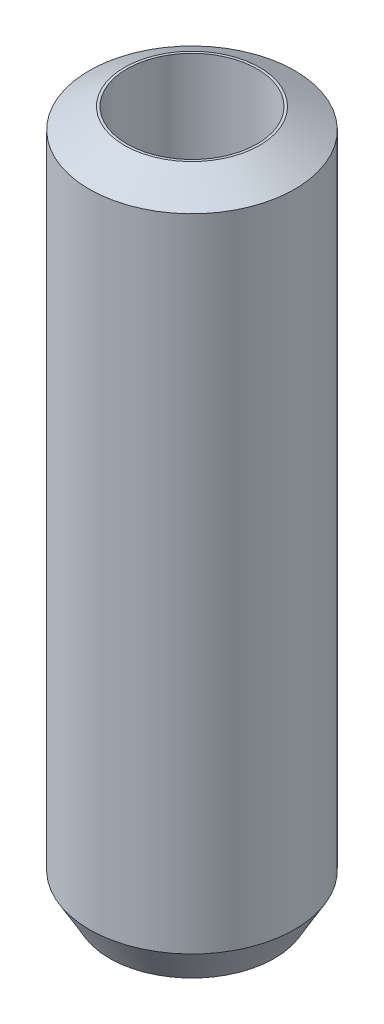
ISO-10303-21;
HEADER;
FILE_DESCRIPTION(('STEP AP214'),'2;1');
FILE_NAME('part.step','',(''),(''),'','','');
FILE_SCHEMA(('AUTOMOTIVE_DESIGN { 1 0 10303 214 1 1 1 1 }'));
ENDSEC;
DATA;
#1=APPLICATION_CONTEXT('core data for automotive mechanical design processes');
#2=APPLICATION_PROTOCOL_DEFINITION('international standard','automotive_design',2000,#1);
#3=PRODUCT_CONTEXT('',#1,'mechanical');
#4=PRODUCT('Part','Part','',(#3));
#5=PRODUCT_RELATED_PRODUCT_CATEGORY('part','',(#4));
#6=PRODUCT_DEFINITION_FORMATION('','',#4);
#7=PRODUCT_DEFINITION_CONTEXT('part definition',#1,'design');
#8=PRODUCT_DEFINITION('design','',#6,#7);
#9=PRODUCT_DEFINITION_SHAPE('','',#8);
#10=(LENGTH_UNIT() NAMED_UNIT(*) SI_UNIT(.MILLI.,.METRE.));
#11=(NAMED_UNIT(*) PLANE_ANGLE_UNIT() SI_UNIT($,.RADIAN.));
#12=(NAMED_UNIT(*) SI_UNIT($,.STERADIAN.) SOLID_ANGLE_UNIT());
#13=UNCERTAINTY_MEASURE_WITH_UNIT(LENGTH_MEASURE(1.E-05),#10,'distance_accuracy_value','');
#14=(GEOMETRIC_REPRESENTATION_CONTEXT(3) GLOBAL_UNCERTAINTY_ASSIGNED_CONTEXT((#13)) GLOBAL_UNIT_ASSIGNED_CONTEXT((#10,
#11,#12)) REPRESENTATION_CONTEXT('',''));
#15=CARTESIAN_POINT('',(0.,0.,0.));
#16=DIRECTION('',(0.,0.,1.));
#17=DIRECTION('',(1.,0.,0.));
#18=AXIS2_PLACEMENT_3D('',#15,#16,#17);
#19=CARTESIAN_POINT('',(0.,118.622075651128,0.));
#20=DIRECTION('',(0.,-1.,0.));
#21=DIRECTION('',(0.,0.,-1.));
#22=AXIS2_PLACEMENT_3D('',#19,#20,#21);
#23=CYLINDRICAL_SURFACE('',#22,17.5);
#24=CARTESIAN_POINT('',(0.,115.161099034734,0.));
#25=DIRECTION('',(0.,1.,0.));
#26=DIRECTION('',(0.,0.,1.));
#27=AXIS2_PLACEMENT_3D('',#24,#25,#26);
#28=CIRCLE('',#27,17.5);
#29=CARTESIAN_POINT('',(0.,115.161099034734,17.5));
#30=VERTEX_POINT('',#29);
#31=EDGE_CURVE('E50',#30,#30,#28,.F.);
#32=ORIENTED_EDGE('',*,*,#31,.T.);
#33=EDGE_LOOP('',(#32));
#34=FACE_BOUND('',#33,.T.);
#35=CARTESIAN_POINT('',(0.,5.99458734340222,0.));
#36=DIRECTION('',(0.,1.,0.));
#37=DIRECTION('',(0.,0.,1.));
#38=AXIS2_PLACEMENT_3D('',#35,#36,#37);
#39=CIRCLE('',#38,17.5);
#40=CARTESIAN_POINT('',(0.,5.99458734340222,17.5));
#41=VERTEX_POINT('',#40);
#42=EDGE_CURVE('E51',#41,#41,#39,.T.);
#43=ORIENTED_EDGE('',*,*,#42,.T.);
#44=EDGE_LOOP('',(#43));
#45=FACE_BOUND('',#44,.T.);
#46=ADVANCED_FACE('F39',(#34,#45),#23,.T.);
#47=CARTESIAN_POINT('',(0.,118.622075651128,0.));
#48=DIRECTION('',(0.,1.,0.));
#49=DIRECTION('',(0.,0.,1.));
#50=AXIS2_PLACEMENT_3D('',#47,#48,#49);
#51=PLANE('',#50);
#52=CARTESIAN_POINT('',(0.,118.622075651128,0.));
#53=DIRECTION('',(0.,1.,0.));
#54=DIRECTION('',(0.,0.,1.));
#55=AXIS2_PLACEMENT_3D('',#52,#53,#54);
#56=CIRCLE('',#55,11.5054126565978);
#57=CARTESIAN_POINT('',(0.,118.622075651128,11.5054126565978));
#58=VERTEX_POINT('',#57);
#59=EDGE_CURVE('E54',#58,#58,#56,.T.);
#60=ORIENTED_EDGE('',*,*,#59,.T.);
#61=EDGE_LOOP('',(#60));
#62=FACE_BOUND('',#61,.T.);
#63=CARTESIAN_POINT('',(0.,118.622075651128,0.));
#64=DIRECTION('',(0.,1.,0.));
#65=DIRECTION('',(0.,0.,1.));
#66=AXIS2_PLACEMENT_3D('',#63,#64,#65);
#67=CIRCLE('',#66,11.0839047274035);
#68=CARTESIAN_POINT('',(0.,118.622075651128,11.0839047274035));
#69=VERTEX_POINT('',#68);
#70=EDGE_CURVE('E58',#69,#69,#67,.T.);
#71=ORIENTED_EDGE('',*,*,#70,.F.);
#72=EDGE_LOOP('',(#71));
#73=FACE_BOUND('',#72,.T.);
#74=ADVANCED_FACE('F69',(#62,#73),#51,.T.);
#75=CARTESIAN_POINT('',(0.,0.,0.));
#76=DIRECTION('',(0.,1.,0.));
#77=DIRECTION('',(0.,0.,1.));
#78=AXIS2_PLACEMENT_3D('',#75,#76,#77);
#79=PLANE('',#78);
#80=CARTESIAN_POINT('',(0.,0.,0.));
#81=DIRECTION('',(0.,1.,0.));
#82=DIRECTION('',(0.,0.,1.));
#83=AXIS2_PLACEMENT_3D('',#80,#81,#82);
#84=CIRCLE('',#83,14.039023383606);
#85=CARTESIAN_POINT('',(0.,0.,14.039023383606));
#86=VERTEX_POINT('',#85);
#87=EDGE_CURVE('E10',#86,#86,#84,.F.);
#88=ORIENTED_EDGE('',*,*,#87,.T.);
#89=EDGE_LOOP('',(#88));
#90=FACE_BOUND('',#89,.T.);
#91=CARTESIAN_POINT('',(0.,0.,0.));
#92=DIRECTION('',(0.,1.,0.));
#93=DIRECTION('',(0.,0.,1.));
#94=AXIS2_PLACEMENT_3D('',#91,#92,#93);
#95=CIRCLE('',#94,11.0839047274035);
#96=CARTESIAN_POINT('',(0.,0.,11.0839047274035));
#97=VERTEX_POINT('',#96);
#98=EDGE_CURVE('E63',#97,#97,#95,.T.);
#99=ORIENTED_EDGE('',*,*,#98,.T.);
#100=EDGE_LOOP('',(#99));
#101=FACE_BOUND('',#100,.T.);
#102=ADVANCED_FACE('F75',(#90,#101),#79,.F.);
#103=CARTESIAN_POINT('',(0.,118.622075651128,0.));
#104=DIRECTION('',(0.,-1.,0.));
#105=DIRECTION('',(0.,0.,-1.));
#106=AXIS2_PLACEMENT_3D('',#103,#104,#105);
#107=CYLINDRICAL_SURFACE('',#106,11.0839047274035);
#108=ORIENTED_EDGE('',*,*,#70,.T.);
#109=EDGE_LOOP('',(#108));
#110=FACE_BOUND('',#109,.T.);
#111=ORIENTED_EDGE('',*,*,#98,.F.);
#112=EDGE_LOOP('',(#111));
#113=FACE_BOUND('',#112,.T.);
#114=ADVANCED_FACE('F70',(#110,#113),#107,.F.);
#115=CARTESIAN_POINT('',(0.,118.622075651128,0.));
#116=DIRECTION('',(0.,-1.,0.));
#117=DIRECTION('',(0.,0.,-1.));
#118=AXIS2_PLACEMENT_3D('',#115,#116,#117);
#119=CONICAL_SURFACE('',#118,11.5054126565978,1.0471975511966);
#120=ORIENTED_EDGE('',*,*,#31,.F.);
#121=EDGE_LOOP('',(#120));
#122=FACE_BOUND('',#121,.T.);
#123=ORIENTED_EDGE('',*,*,#59,.F.);
#124=EDGE_LOOP('',(#123));
#125=FACE_BOUND('',#124,.T.);
#126=ADVANCED_FACE('F81',(#122,#125),#119,.T.);
#127=CARTESIAN_POINT('',(0.,5.99458734340222,0.));
#128=DIRECTION('',(0.,1.,0.));
#129=DIRECTION('',(0.,0.,1.));
#130=AXIS2_PLACEMENT_3D('',#127,#128,#129);
#131=CONICAL_SURFACE('',#130,17.5,0.523598775598302);
#132=CARTESIAN_POINT('',(0.,0.,14.039023383606));
#133=CARTESIAN_POINT('',(0.,0.0624436181604387,14.0750752233601));
#134=CARTESIAN_POINT('',(0.,0.124887236320879,14.1111270631142));
#135=CARTESIAN_POINT('',(0.,0.249774472641758,14.1832307426224));
#136=CARTESIAN_POINT('',(0.,0.312218090802198,14.2192825823765));
#137=CARTESIAN_POINT('',(0.,0.437105327123078,14.2913862618847));
#138=CARTESIAN_POINT('',(0.,0.499548945283518,14.3274381016388));
#139=CARTESIAN_POINT('',(0.,0.624436181604397,14.399541781147));
#140=CARTESIAN_POINT('',(0.,0.686879799764837,14.4355936209011));
#141=CARTESIAN_POINT('',(0.,0.811767036085716,14.5076973004093));
#142=CARTESIAN_POINT('',(0.,0.874210654246156,14.5437491401634));
#143=CARTESIAN_POINT('',(0.,0.999097890567035,14.6158528196717));
#144=CARTESIAN_POINT('',(0.,1.06154150872748,14.6519046594258));
#145=CARTESIAN_POINT('',(0.,1.18642874504836,14.724008338934));
#146=CARTESIAN_POINT('',(0.,1.2488723632088,14.7600601786881));
#147=CARTESIAN_POINT('',(0.,1.37375959952967,14.8321638581963));
#148=CARTESIAN_POINT('',(0.,1.43620321769011,14.8682156979504));
#149=CARTESIAN_POINT('',(0.,1.56109045401099,14.9403193774586));
#150=CARTESIAN_POINT('',(0.,1.62353407217143,14.9763712172127));
#151=CARTESIAN_POINT('',(0.,1.74842130849231,15.0484748967209));
#152=CARTESIAN_POINT('',(0.,1.81086492665275,15.084526736475));
#153=CARTESIAN_POINT('',(0.,1.93575216297363,15.1566304159832));
#154=CARTESIAN_POINT('',(0.,1.99819578113407,15.1926822557373));
#155=CARTESIAN_POINT('',(0.,2.12308301745495,15.2647859352455));
#156=CARTESIAN_POINT('',(0.,2.18552663561539,15.3008377749996));
#157=CARTESIAN_POINT('',(0.,2.31041387193627,15.3729414545078));
#158=CARTESIAN_POINT('',(0.,2.37285749009671,15.408993294262));
#159=CARTESIAN_POINT('',(0.,2.49774472641759,15.4810969737702));
#160=CARTESIAN_POINT('',(0.,2.56018834457803,15.5171488135243));
#161=CARTESIAN_POINT('',(0.,2.68507558089891,15.5892524930325));
#162=CARTESIAN_POINT('',(0.,2.74751919905935,15.6253043327866));
#163=CARTESIAN_POINT('',(0.,2.87240643538023,15.6974080122948));
#164=CARTESIAN_POINT('',(0.,2.93485005354067,15.7334598520489));
#165=CARTESIAN_POINT('',(0.,3.05973728986155,15.8055635315571));
#166=CARTESIAN_POINT('',(0.,3.12218090802199,15.8416153713112));
#167=CARTESIAN_POINT('',(0.,3.24706814434287,15.9137190508194));
#168=CARTESIAN_POINT('',(0.,3.30951176250331,15.9497708905735));
#169=CARTESIAN_POINT('',(0.,3.43439899882419,16.0218745700817));
#170=CARTESIAN_POINT('',(0.,3.49684261698463,16.0579264098358));
#171=CARTESIAN_POINT('',(0.,3.62172985330551,16.130030089344));
#172=CARTESIAN_POINT('',(0.,3.68417347146595,16.1660819290981));
#173=CARTESIAN_POINT('',(0.,3.80906070778683,16.2381856086064));
#174=CARTESIAN_POINT('',(0.,3.87150432594727,16.2742374483605));
#175=CARTESIAN_POINT('',(0.,3.99639156226815,16.3463411278687));
#176=CARTESIAN_POINT('',(0.,4.05883518042858,16.3823929676228));
#177=CARTESIAN_POINT('',(0.,4.18372241674946,16.454496647131));
#178=CARTESIAN_POINT('',(0.,4.2461660349099,16.4905484868851));
#179=CARTESIAN_POINT('',(0.,4.37105327123078,16.5626521663933));
#180=CARTESIAN_POINT('',(0.,4.43349688939122,16.5987040061474));
#181=CARTESIAN_POINT('',(0.,4.5583841257121,16.6708076856556));
#182=CARTESIAN_POINT('',(0.,4.62082774387254,16.7068595254097));
#183=CARTESIAN_POINT('',(0.,4.74571498019342,16.7789632049179));
#184=CARTESIAN_POINT('',(0.,4.80815859835386,16.815015044672));
#185=CARTESIAN_POINT('',(0.,4.93304583467474,16.8871187241802));
#186=CARTESIAN_POINT('',(0.,4.99548945283518,16.9231705639343));
#187=CARTESIAN_POINT('',(0.,5.12037668915606,16.9952742434425));
#188=CARTESIAN_POINT('',(0.,5.1828203073165,17.0313260831966));
#189=CARTESIAN_POINT('',(0.,5.30770754363738,17.1034297627049));
#190=CARTESIAN_POINT('',(0.,5.37015116179782,17.139481602459));
#191=CARTESIAN_POINT('',(0.,5.4950383981187,17.2115852819672));
#192=CARTESIAN_POINT('',(0.,5.55748201627914,17.2476371217213));
#193=CARTESIAN_POINT('',(0.,5.68236925260002,17.3197408012295));
#194=CARTESIAN_POINT('',(0.,5.74481287076046,17.3557926409836));
#195=CARTESIAN_POINT('',(0.,5.86970010708134,17.4278963204918));
#196=CARTESIAN_POINT('',(0.,5.93214372524178,17.4639481602459));
#197=CARTESIAN_POINT('',(0.,5.99458734340222,17.5));
#198=B_SPLINE_CURVE_WITH_KNOTS('',3,(#132,#133,#134,#135,#136,#137,#138,#139,#140,#141,#142,
#143,#144,#145,#146,#147,#148,#149,#150,#151,#152,#153,#154,#155,#156,#157,#158,#159,#160,#161,
#162,#163,#164,#165,#166,#167,#168,#169,#170,#171,#172,#173,#174,#175,#176,#177,#178,#179,#180,
#181,#182,#183,#184,#185,#186,#187,#188,#189,#190,#191,#192,#193,#194,#195,#196,#197),
.UNSPECIFIED.,.F.,.F.,(4,2,2,2,2,2,2,2,2,2,2,2,2,2,2,2,2,2,2,2,2,2,2,2,2,2,2,2,2,2,2,2,4),(0.,
0.216311038524626,0.43262207704925,0.648933115573875,0.865244154098501,1.08155519262313,
1.29786623114775,1.51417726967238,1.730488308197,1.94679934672163,2.16311038524625,
2.37942142377088,2.5957324622955,2.81204350082013,3.02835453934475,3.24466557786938,
3.460976616394,3.67728765491863,3.89359869344325,4.10990973196788,4.3262207704925,
4.54253180901713,4.75884284754175,4.97515388606638,5.191464924591,5.40777596311563,
5.62408700164025,5.84039804016488,6.0567090786895,6.27302011721413,6.48933115573876,
6.70564219426338,6.92195323278801),.UNSPECIFIED.);
#199=EDGE_CURVE('BSEAM45',#86,#41,#198,.T.);
#200=ORIENTED_EDGE('',*,*,#87,.F.);
#201=ORIENTED_EDGE('',*,*,#42,.F.);
#202=ORIENTED_EDGE('',*,*,#199,.T.);
#203=ORIENTED_EDGE('',*,*,#199,.F.);
#204=EDGE_LOOP('',(#200,#202,#201,#203));
#205=FACE_BOUND('',#204,.T.);
#206=ADVANCED_FACE('F45',(#205),#131,.T.);
#207=CLOSED_SHELL('',(#46,#74,#102,#114,#126,#206));
#208=MANIFOLD_SOLID_BREP('B2',#207);
#209=ADVANCED_BREP_SHAPE_REPRESENTATION('',(#18,#208),#14);
#210=SHAPE_DEFINITION_REPRESENTATION(#9,#209);
ENDSEC;
END-ISO-10303-21;
